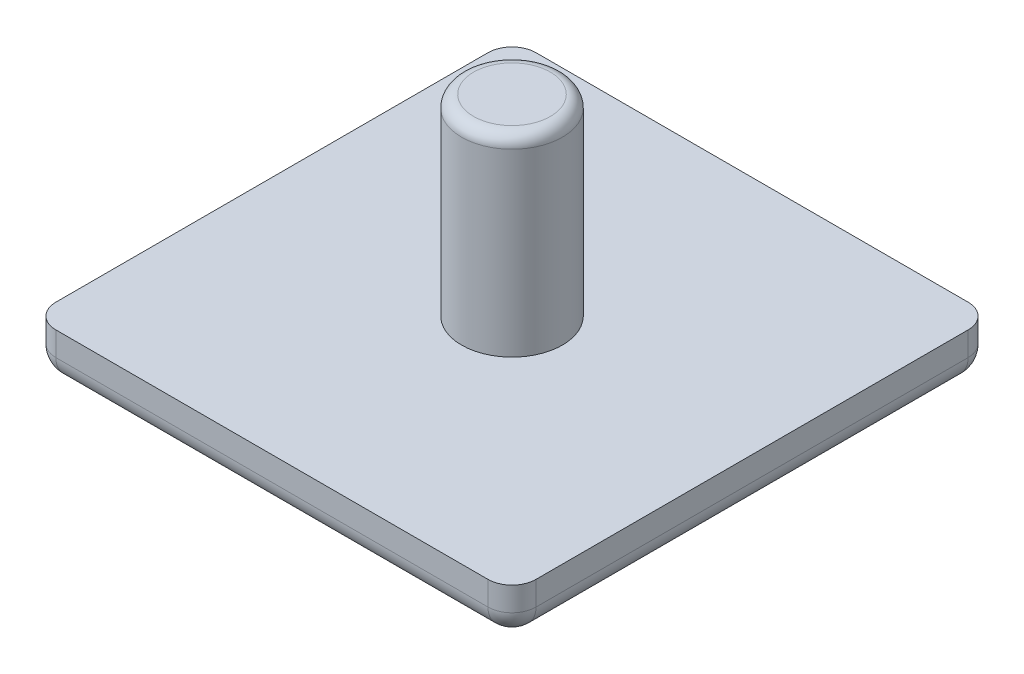
ISO-10303-21;
HEADER;
FILE_DESCRIPTION(('STEP AP214'),'2;1');
FILE_NAME('part.step','',(''),(''),'','','');
FILE_SCHEMA(('AUTOMOTIVE_DESIGN { 1 0 10303 214 1 1 1 1 }'));
ENDSEC;
DATA;
#1=APPLICATION_CONTEXT('core data for automotive mechanical design processes');
#2=APPLICATION_PROTOCOL_DEFINITION('international standard','automotive_design',2000,#1);
#3=PRODUCT_CONTEXT('',#1,'mechanical');
#4=PRODUCT('Part','Part','',(#3));
#5=PRODUCT_RELATED_PRODUCT_CATEGORY('part','',(#4));
#6=PRODUCT_DEFINITION_FORMATION('','',#4);
#7=PRODUCT_DEFINITION_CONTEXT('part definition',#1,'design');
#8=PRODUCT_DEFINITION('design','',#6,#7);
#9=PRODUCT_DEFINITION_SHAPE('','',#8);
#10=(LENGTH_UNIT() NAMED_UNIT(*) SI_UNIT(.MILLI.,.METRE.));
#11=(NAMED_UNIT(*) PLANE_ANGLE_UNIT() SI_UNIT($,.RADIAN.));
#12=(NAMED_UNIT(*) SI_UNIT($,.STERADIAN.) SOLID_ANGLE_UNIT());
#13=UNCERTAINTY_MEASURE_WITH_UNIT(LENGTH_MEASURE(1.E-05),#10,'distance_accuracy_value','');
#14=(GEOMETRIC_REPRESENTATION_CONTEXT(3) GLOBAL_UNCERTAINTY_ASSIGNED_CONTEXT((#13)) GLOBAL_UNIT_ASSIGNED_CONTEXT((#10,
#11,#12)) REPRESENTATION_CONTEXT('',''));
#15=CARTESIAN_POINT('',(0.,0.,0.));
#16=DIRECTION('',(0.,0.,1.));
#17=DIRECTION('',(1.,0.,0.));
#18=AXIS2_PLACEMENT_3D('',#15,#16,#17);
#19=CARTESIAN_POINT('',(10.,8.,-10.));
#20=DIRECTION('',(0.,-1.,0.));
#21=DIRECTION('',(0.,0.,-1.));
#22=AXIS2_PLACEMENT_3D('',#19,#20,#21);
#23=CYLINDRICAL_SURFACE('',#22,2.1);
#24=CARTESIAN_POINT('',(10.,7.5,-10.));
#25=DIRECTION('',(0.,1.,0.));
#26=DIRECTION('',(0.,0.,1.));
#27=AXIS2_PLACEMENT_3D('',#24,#25,#26);
#28=CIRCLE('',#27,2.1);
#29=CARTESIAN_POINT('',(10.,7.5,-7.9));
#30=VERTEX_POINT('',#29);
#31=EDGE_CURVE('E147',#30,#30,#28,.F.);
#32=ORIENTED_EDGE('',*,*,#31,.T.);
#33=EDGE_LOOP('',(#32));
#34=FACE_BOUND('',#33,.T.);
#35=CARTESIAN_POINT('',(10.,0.,-10.));
#36=DIRECTION('',(0.,1.,0.));
#37=DIRECTION('',(0.,0.,1.));
#38=AXIS2_PLACEMENT_3D('',#35,#36,#37);
#39=CIRCLE('',#38,2.1);
#40=CARTESIAN_POINT('',(10.,0.,-7.9));
#41=VERTEX_POINT('',#40);
#42=EDGE_CURVE('E159',#41,#41,#39,.T.);
#43=ORIENTED_EDGE('',*,*,#42,.T.);
#44=EDGE_LOOP('',(#43));
#45=FACE_BOUND('',#44,.T.);
#46=ADVANCED_FACE('F45',(#34,#45),#23,.T.);
#47=CARTESIAN_POINT('',(10.,8.,-10.));
#48=DIRECTION('',(0.,1.,0.));
#49=DIRECTION('',(0.,0.,1.));
#50=AXIS2_PLACEMENT_3D('',#47,#48,#49);
#51=PLANE('',#50);
#52=CARTESIAN_POINT('',(10.,8.,-10.));
#53=DIRECTION('',(0.,1.,0.));
#54=DIRECTION('',(0.,0.,1.));
#55=AXIS2_PLACEMENT_3D('',#52,#53,#54);
#56=CIRCLE('',#55,1.6);
#57=CARTESIAN_POINT('',(10.,8.,-8.4));
#58=VERTEX_POINT('',#57);
#59=EDGE_CURVE('E177',#58,#58,#56,.T.);
#60=ORIENTED_EDGE('',*,*,#59,.T.);
#61=EDGE_LOOP('',(#60));
#62=FACE_BOUND('',#61,.T.);
#63=ADVANCED_FACE('F284',(#62),#51,.T.);
#64=CARTESIAN_POINT('',(0.,-2.,0.));
#65=DIRECTION('',(1.,0.,0.));
#66=DIRECTION('',(0.,0.,-1.));
#67=AXIS2_PLACEMENT_3D('',#64,#65,#66);
#68=PLANE('',#67);
#69=DIRECTION('',(0.,0.,-1.));
#70=VECTOR('',#69,1.);
#71=CARTESIAN_POINT('',(0.,0.,0.));
#72=LINE('',#71,#70);
#73=CARTESIAN_POINT('',(0.,0.,-1.));
#74=VERTEX_POINT('',#73);
#75=CARTESIAN_POINT('',(0.,0.,-19.));
#76=VERTEX_POINT('',#75);
#77=EDGE_CURVE('E189',#74,#76,#72,.T.);
#78=ORIENTED_EDGE('',*,*,#77,.T.);
#79=DIRECTION('',(0.,1.,0.));
#80=VECTOR('',#79,1.);
#81=CARTESIAN_POINT('',(0.,-2.,-19.));
#82=LINE('',#81,#80);
#83=CARTESIAN_POINT('',(0.,-1.,-19.));
#84=VERTEX_POINT('',#83);
#85=EDGE_CURVE('E212',#76,#84,#82,.F.);
#86=ORIENTED_EDGE('',*,*,#85,.T.);
#87=DIRECTION('',(0.,0.,-1.));
#88=VECTOR('',#87,1.);
#89=CARTESIAN_POINT('',(0.,-1.,0.));
#90=LINE('',#89,#88);
#91=CARTESIAN_POINT('',(0.,-1.,-1.));
#92=VERTEX_POINT('',#91);
#93=EDGE_CURVE('E175',#84,#92,#90,.F.);
#94=ORIENTED_EDGE('',*,*,#93,.T.);
#95=DIRECTION('',(0.,1.,0.));
#96=VECTOR('',#95,1.);
#97=CARTESIAN_POINT('',(0.,-2.,-1.));
#98=LINE('',#97,#96);
#99=EDGE_CURVE('E135',#92,#74,#98,.T.);
#100=ORIENTED_EDGE('',*,*,#99,.T.);
#101=EDGE_LOOP('',(#78,#86,#94,#100));
#102=FACE_BOUND('',#101,.T.);
#103=ADVANCED_FACE('F240',(#102),#68,.F.);
#104=CARTESIAN_POINT('',(0.,-2.,-20.));
#105=DIRECTION('',(0.,0.,1.));
#106=DIRECTION('',(1.,0.,0.));
#107=AXIS2_PLACEMENT_3D('',#104,#105,#106);
#108=PLANE('',#107);
#109=DIRECTION('',(1.,0.,0.));
#110=VECTOR('',#109,1.);
#111=CARTESIAN_POINT('',(0.,-1.,-20.));
#112=LINE('',#111,#110);
#113=CARTESIAN_POINT('',(19.,-1.,-20.));
#114=VERTEX_POINT('',#113);
#115=CARTESIAN_POINT('',(1.,-1.,-20.));
#116=VERTEX_POINT('',#115);
#117=EDGE_CURVE('E172',#114,#116,#112,.F.);
#118=ORIENTED_EDGE('',*,*,#117,.T.);
#119=DIRECTION('',(0.,1.,0.));
#120=VECTOR('',#119,1.);
#121=CARTESIAN_POINT('',(1.,-2.,-20.));
#122=LINE('',#121,#120);
#123=CARTESIAN_POINT('',(1.,0.,-20.));
#124=VERTEX_POINT('',#123);
#125=EDGE_CURVE('E205',#116,#124,#122,.T.);
#126=ORIENTED_EDGE('',*,*,#125,.T.);
#127=DIRECTION('',(1.,0.,0.));
#128=VECTOR('',#127,1.);
#129=CARTESIAN_POINT('',(0.,0.,-20.));
#130=LINE('',#129,#128);
#131=CARTESIAN_POINT('',(19.,0.,-20.));
#132=VERTEX_POINT('',#131);
#133=EDGE_CURVE('E245',#124,#132,#130,.T.);
#134=ORIENTED_EDGE('',*,*,#133,.T.);
#135=DIRECTION('',(0.,1.,0.));
#136=VECTOR('',#135,1.);
#137=CARTESIAN_POINT('',(19.,-2.,-20.));
#138=LINE('',#137,#136);
#139=EDGE_CURVE('E203',#132,#114,#138,.F.);
#140=ORIENTED_EDGE('',*,*,#139,.T.);
#141=EDGE_LOOP('',(#118,#126,#134,#140));
#142=FACE_BOUND('',#141,.T.);
#143=ADVANCED_FACE('F265',(#142),#108,.F.);
#144=CARTESIAN_POINT('',(20.,-2.,0.));
#145=DIRECTION('',(-1.,0.,0.));
#146=DIRECTION('',(0.,0.,1.));
#147=AXIS2_PLACEMENT_3D('',#144,#145,#146);
#148=PLANE('',#147);
#149=DIRECTION('',(0.,0.,1.));
#150=VECTOR('',#149,1.);
#151=CARTESIAN_POINT('',(20.,-1.,-20.));
#152=LINE('',#151,#150);
#153=CARTESIAN_POINT('',(20.,-1.,-1.));
#154=VERTEX_POINT('',#153);
#155=CARTESIAN_POINT('',(20.,-1.,-19.));
#156=VERTEX_POINT('',#155);
#157=EDGE_CURVE('E166',#154,#156,#152,.F.);
#158=ORIENTED_EDGE('',*,*,#157,.T.);
#159=DIRECTION('',(0.,1.,0.));
#160=VECTOR('',#159,1.);
#161=CARTESIAN_POINT('',(20.,-2.,-19.));
#162=LINE('',#161,#160);
#163=CARTESIAN_POINT('',(20.,0.,-19.));
#164=VERTEX_POINT('',#163);
#165=EDGE_CURVE('E54',#156,#164,#162,.T.);
#166=ORIENTED_EDGE('',*,*,#165,.T.);
#167=DIRECTION('',(0.,0.,1.));
#168=VECTOR('',#167,1.);
#169=CARTESIAN_POINT('',(20.,0.,0.));
#170=LINE('',#169,#168);
#171=CARTESIAN_POINT('',(20.,0.,-1.));
#172=VERTEX_POINT('',#171);
#173=EDGE_CURVE('E248',#164,#172,#170,.T.);
#174=ORIENTED_EDGE('',*,*,#173,.T.);
#175=DIRECTION('',(0.,1.,0.));
#176=VECTOR('',#175,1.);
#177=CARTESIAN_POINT('',(20.,-2.,-1.));
#178=LINE('',#177,#176);
#179=EDGE_CURVE('E214',#172,#154,#178,.F.);
#180=ORIENTED_EDGE('',*,*,#179,.T.);
#181=EDGE_LOOP('',(#158,#166,#174,#180));
#182=FACE_BOUND('',#181,.T.);
#183=ADVANCED_FACE('F436',(#182),#148,.F.);
#184=CARTESIAN_POINT('',(0.,-2.,0.));
#185=DIRECTION('',(0.,0.,-1.));
#186=DIRECTION('',(-1.,0.,0.));
#187=AXIS2_PLACEMENT_3D('',#184,#185,#186);
#188=PLANE('',#187);
#189=DIRECTION('',(-1.,0.,0.));
#190=VECTOR('',#189,1.);
#191=CARTESIAN_POINT('',(20.,-1.,0.));
#192=LINE('',#191,#190);
#193=CARTESIAN_POINT('',(1.,-1.,0.));
#194=VERTEX_POINT('',#193);
#195=CARTESIAN_POINT('',(19.,-1.,0.));
#196=VERTEX_POINT('',#195);
#197=EDGE_CURVE('E146',#194,#196,#192,.F.);
#198=ORIENTED_EDGE('',*,*,#197,.T.);
#199=DIRECTION('',(0.,1.,0.));
#200=VECTOR('',#199,1.);
#201=CARTESIAN_POINT('',(19.,-2.,0.));
#202=LINE('',#201,#200);
#203=CARTESIAN_POINT('',(19.,0.,0.));
#204=VERTEX_POINT('',#203);
#205=EDGE_CURVE('E11',#196,#204,#202,.T.);
#206=ORIENTED_EDGE('',*,*,#205,.T.);
#207=DIRECTION('',(-1.,0.,0.));
#208=VECTOR('',#207,1.);
#209=CARTESIAN_POINT('',(0.,0.,0.));
#210=LINE('',#209,#208);
#211=CARTESIAN_POINT('',(1.,0.,0.));
#212=VERTEX_POINT('',#211);
#213=EDGE_CURVE('E233',#204,#212,#210,.T.);
#214=ORIENTED_EDGE('',*,*,#213,.T.);
#215=DIRECTION('',(0.,1.,0.));
#216=VECTOR('',#215,1.);
#217=CARTESIAN_POINT('',(1.,-2.,0.));
#218=LINE('',#217,#216);
#219=EDGE_CURVE('E186',#212,#194,#218,.F.);
#220=ORIENTED_EDGE('',*,*,#219,.T.);
#221=EDGE_LOOP('',(#198,#206,#214,#220));
#222=FACE_BOUND('',#221,.T.);
#223=ADVANCED_FACE('F231',(#222),#188,.F.);
#224=CARTESIAN_POINT('',(0.,-2.,0.));
#225=DIRECTION('',(0.,-1.,0.));
#226=DIRECTION('',(0.,0.,-1.));
#227=AXIS2_PLACEMENT_3D('',#224,#225,#226);
#228=PLANE('',#227);
#229=DIRECTION('',(0.,0.,1.));
#230=VECTOR('',#229,1.);
#231=CARTESIAN_POINT('',(19.,-2.,0.));
#232=LINE('',#231,#230);
#233=CARTESIAN_POINT('',(19.,-2.,-19.));
#234=VERTEX_POINT('',#233);
#235=CARTESIAN_POINT('',(19.,-2.,-1.));
#236=VERTEX_POINT('',#235);
#237=EDGE_CURVE('E164',#234,#236,#232,.T.);
#238=ORIENTED_EDGE('',*,*,#237,.T.);
#239=DIRECTION('',(-1.,0.,0.));
#240=VECTOR('',#239,1.);
#241=CARTESIAN_POINT('',(0.,-2.,-1.));
#242=LINE('',#241,#240);
#243=CARTESIAN_POINT('',(1.,-2.,-1.));
#244=VERTEX_POINT('',#243);
#245=EDGE_CURVE('E143',#236,#244,#242,.T.);
#246=ORIENTED_EDGE('',*,*,#245,.T.);
#247=DIRECTION('',(0.,0.,-1.));
#248=VECTOR('',#247,1.);
#249=CARTESIAN_POINT('',(1.,-2.,-20.));
#250=LINE('',#249,#248);
#251=CARTESIAN_POINT('',(1.,-2.,-19.));
#252=VERTEX_POINT('',#251);
#253=EDGE_CURVE('E151',#244,#252,#250,.T.);
#254=ORIENTED_EDGE('',*,*,#253,.T.);
#255=DIRECTION('',(1.,0.,0.));
#256=VECTOR('',#255,1.);
#257=CARTESIAN_POINT('',(20.,-2.,-19.));
#258=LINE('',#257,#256);
#259=EDGE_CURVE('E158',#252,#234,#258,.T.);
#260=ORIENTED_EDGE('',*,*,#259,.T.);
#261=EDGE_LOOP('',(#238,#246,#254,#260));
#262=FACE_BOUND('',#261,.T.);
#263=ADVANCED_FACE('F162',(#262),#228,.T.);
#264=CARTESIAN_POINT('',(0.,0.,0.));
#265=DIRECTION('',(0.,-1.,0.));
#266=DIRECTION('',(0.,0.,-1.));
#267=AXIS2_PLACEMENT_3D('',#264,#265,#266);
#268=PLANE('',#267);
#269=ORIENTED_EDGE('',*,*,#42,.F.);
#270=EDGE_LOOP('',(#269));
#271=FACE_BOUND('',#270,.T.);
#272=ORIENTED_EDGE('',*,*,#133,.F.);
#273=CARTESIAN_POINT('',(1.,0.,-19.));
#274=DIRECTION('',(0.,-1.,0.));
#275=DIRECTION('',(0.,0.,-1.));
#276=AXIS2_PLACEMENT_3D('',#273,#274,#275);
#277=CIRCLE('',#276,1.);
#278=EDGE_CURVE('E210',#124,#76,#277,.F.);
#279=ORIENTED_EDGE('',*,*,#278,.T.);
#280=ORIENTED_EDGE('',*,*,#77,.F.);
#281=CARTESIAN_POINT('',(1.,0.,-1.));
#282=DIRECTION('',(0.,-1.,0.));
#283=DIRECTION('',(0.,0.,-1.));
#284=AXIS2_PLACEMENT_3D('',#281,#282,#283);
#285=CIRCLE('',#284,1.);
#286=EDGE_CURVE('E183',#74,#212,#285,.F.);
#287=ORIENTED_EDGE('',*,*,#286,.T.);
#288=ORIENTED_EDGE('',*,*,#213,.F.);
#289=CARTESIAN_POINT('',(19.,0.,-1.));
#290=DIRECTION('',(0.,-1.,0.));
#291=DIRECTION('',(0.,0.,-1.));
#292=AXIS2_PLACEMENT_3D('',#289,#290,#291);
#293=CIRCLE('',#292,1.);
#294=EDGE_CURVE('E62',#204,#172,#293,.F.);
#295=ORIENTED_EDGE('',*,*,#294,.T.);
#296=ORIENTED_EDGE('',*,*,#173,.F.);
#297=CARTESIAN_POINT('',(19.,0.,-19.));
#298=DIRECTION('',(0.,-1.,0.));
#299=DIRECTION('',(0.,0.,-1.));
#300=AXIS2_PLACEMENT_3D('',#297,#298,#299);
#301=CIRCLE('',#300,1.);
#302=EDGE_CURVE('E208',#164,#132,#301,.F.);
#303=ORIENTED_EDGE('',*,*,#302,.T.);
#304=EDGE_LOOP('',(#272,#279,#280,#287,#288,#295,#296,#303));
#305=FACE_BOUND('',#304,.T.);
#306=ADVANCED_FACE('F243',(#271,#305),#268,.F.);
#307=CARTESIAN_POINT('',(0.,-1.,-19.));
#308=DIRECTION('',(-1.,0.,0.));
#309=DIRECTION('',(0.,0.,1.));
#310=AXIS2_PLACEMENT_3D('',#307,#308,#309);
#311=CYLINDRICAL_SURFACE('',#310,1.);
#312=ORIENTED_EDGE('',*,*,#259,.F.);
#313=CARTESIAN_POINT('',(1.,-1.,-19.));
#314=DIRECTION('',(-1.,0.,0.));
#315=DIRECTION('',(0.,0.,1.));
#316=AXIS2_PLACEMENT_3D('',#313,#314,#315);
#317=CIRCLE('',#316,1.);
#318=EDGE_CURVE('E194',#252,#116,#317,.F.);
#319=ORIENTED_EDGE('',*,*,#318,.T.);
#320=ORIENTED_EDGE('',*,*,#117,.F.);
#321=CARTESIAN_POINT('',(19.,-1.,-19.));
#322=DIRECTION('',(-1.,0.,0.));
#323=DIRECTION('',(0.,0.,1.));
#324=AXIS2_PLACEMENT_3D('',#321,#322,#323);
#325=CIRCLE('',#324,1.);
#326=EDGE_CURVE('E192',#114,#234,#325,.T.);
#327=ORIENTED_EDGE('',*,*,#326,.T.);
#328=EDGE_LOOP('',(#312,#319,#320,#327));
#329=FACE_BOUND('',#328,.T.);
#330=ADVANCED_FACE('F272',(#329),#311,.T.);
#331=CARTESIAN_POINT('',(19.,-1.,0.));
#332=DIRECTION('',(0.,0.,-1.));
#333=DIRECTION('',(-1.,0.,0.));
#334=AXIS2_PLACEMENT_3D('',#331,#332,#333);
#335=CYLINDRICAL_SURFACE('',#334,1.);
#336=ORIENTED_EDGE('',*,*,#237,.F.);
#337=CARTESIAN_POINT('',(19.,-1.,-19.));
#338=DIRECTION('',(0.,0.,-1.));
#339=DIRECTION('',(-1.,0.,0.));
#340=AXIS2_PLACEMENT_3D('',#337,#338,#339);
#341=CIRCLE('',#340,1.);
#342=EDGE_CURVE('E198',#234,#156,#341,.F.);
#343=ORIENTED_EDGE('',*,*,#342,.T.);
#344=ORIENTED_EDGE('',*,*,#157,.F.);
#345=CARTESIAN_POINT('',(19.,-1.,-1.));
#346=DIRECTION('',(0.,0.,-1.));
#347=DIRECTION('',(-1.,0.,0.));
#348=AXIS2_PLACEMENT_3D('',#345,#346,#347);
#349=CIRCLE('',#348,1.);
#350=EDGE_CURVE('E196',#154,#236,#349,.T.);
#351=ORIENTED_EDGE('',*,*,#350,.T.);
#352=EDGE_LOOP('',(#336,#343,#344,#351));
#353=FACE_BOUND('',#352,.T.);
#354=ADVANCED_FACE('F256',(#353),#335,.T.);
#355=CARTESIAN_POINT('',(1.,-1.,0.));
#356=DIRECTION('',(0.,0.,1.));
#357=DIRECTION('',(1.,0.,0.));
#358=AXIS2_PLACEMENT_3D('',#355,#356,#357);
#359=CYLINDRICAL_SURFACE('',#358,1.);
#360=ORIENTED_EDGE('',*,*,#93,.F.);
#361=CARTESIAN_POINT('',(1.,-1.,-19.));
#362=DIRECTION('',(0.,0.,1.));
#363=DIRECTION('',(1.,0.,0.));
#364=AXIS2_PLACEMENT_3D('',#361,#362,#363);
#365=CIRCLE('',#364,1.);
#366=EDGE_CURVE('E154',#84,#252,#365,.T.);
#367=ORIENTED_EDGE('',*,*,#366,.T.);
#368=ORIENTED_EDGE('',*,*,#253,.F.);
#369=CARTESIAN_POINT('',(1.,-1.,-1.));
#370=DIRECTION('',(0.,0.,1.));
#371=DIRECTION('',(1.,0.,0.));
#372=AXIS2_PLACEMENT_3D('',#369,#370,#371);
#373=CIRCLE('',#372,1.);
#374=EDGE_CURVE('E125',#244,#92,#373,.F.);
#375=ORIENTED_EDGE('',*,*,#374,.T.);
#376=EDGE_LOOP('',(#360,#367,#368,#375));
#377=FACE_BOUND('',#376,.T.);
#378=ADVANCED_FACE('F152',(#377),#359,.T.);
#379=CARTESIAN_POINT('',(0.,-1.,-1.));
#380=DIRECTION('',(1.,0.,0.));
#381=DIRECTION('',(0.,0.,-1.));
#382=AXIS2_PLACEMENT_3D('',#379,#380,#381);
#383=CYLINDRICAL_SURFACE('',#382,1.);
#384=ORIENTED_EDGE('',*,*,#245,.F.);
#385=CARTESIAN_POINT('',(19.,-1.,-1.));
#386=DIRECTION('',(1.,0.,0.));
#387=DIRECTION('',(0.,0.,-1.));
#388=AXIS2_PLACEMENT_3D('',#385,#386,#387);
#389=CIRCLE('',#388,1.);
#390=EDGE_CURVE('E201',#236,#196,#389,.F.);
#391=ORIENTED_EDGE('',*,*,#390,.T.);
#392=ORIENTED_EDGE('',*,*,#197,.F.);
#393=CARTESIAN_POINT('',(1.,-1.,-1.));
#394=DIRECTION('',(1.,0.,0.));
#395=DIRECTION('',(0.,0.,-1.));
#396=AXIS2_PLACEMENT_3D('',#393,#394,#395);
#397=CIRCLE('',#396,1.);
#398=EDGE_CURVE('E128',#194,#244,#397,.T.);
#399=ORIENTED_EDGE('',*,*,#398,.T.);
#400=EDGE_LOOP('',(#384,#391,#392,#399));
#401=FACE_BOUND('',#400,.T.);
#402=ADVANCED_FACE('F140',(#401),#383,.T.);
#403=CARTESIAN_POINT('',(10.,7.5,-10.));
#404=DIRECTION('',(0.,1.,0.));
#405=DIRECTION('',(0.,0.,1.));
#406=AXIS2_PLACEMENT_3D('',#403,#404,#405);
#407=TOROIDAL_SURFACE('',#406,1.6,0.5);
#408=ORIENTED_EDGE('',*,*,#31,.F.);
#409=EDGE_LOOP('',(#408));
#410=FACE_BOUND('',#409,.T.);
#411=ORIENTED_EDGE('',*,*,#59,.F.);
#412=EDGE_LOOP('',(#411));
#413=FACE_BOUND('',#412,.T.);
#414=ADVANCED_FACE('F297',(#410,#413),#407,.T.);
#415=CARTESIAN_POINT('',(1.,-2.,-1.));
#416=DIRECTION('',(0.,1.,0.));
#417=DIRECTION('',(0.,0.,1.));
#418=AXIS2_PLACEMENT_3D('',#415,#416,#417);
#419=CYLINDRICAL_SURFACE('',#418,1.);
#420=ORIENTED_EDGE('',*,*,#286,.F.);
#421=ORIENTED_EDGE('',*,*,#99,.F.);
#422=CARTESIAN_POINT('',(1.,-1.,-1.));
#423=DIRECTION('',(0.,-1.,0.));
#424=DIRECTION('',(0.,0.,-1.));
#425=AXIS2_PLACEMENT_3D('',#422,#423,#424);
#426=CIRCLE('',#425,1.);
#427=EDGE_CURVE('E130',#194,#92,#426,.T.);
#428=ORIENTED_EDGE('',*,*,#427,.F.);
#429=ORIENTED_EDGE('',*,*,#219,.F.);
#430=EDGE_LOOP('',(#420,#421,#428,#429));
#431=FACE_BOUND('',#430,.T.);
#432=ADVANCED_FACE('F236',(#431),#419,.T.);
#433=CARTESIAN_POINT('',(1.,-1.,-1.));
#434=DIRECTION('',(0.,0.,1.));
#435=DIRECTION('',(1.,0.,0.));
#436=AXIS2_PLACEMENT_3D('',#433,#434,#435);
#437=SPHERICAL_SURFACE('',#436,1.);
#438=ORIENTED_EDGE('',*,*,#427,.T.);
#439=ORIENTED_EDGE('',*,*,#374,.F.);
#440=ORIENTED_EDGE('',*,*,#398,.F.);
#441=EDGE_LOOP('',(#438,#439,#440));
#442=FACE_BOUND('',#441,.T.);
#443=ADVANCED_FACE('F127',(#442),#437,.T.);
#444=CARTESIAN_POINT('',(1.,-2.,-19.));
#445=DIRECTION('',(0.,1.,0.));
#446=DIRECTION('',(0.,0.,1.));
#447=AXIS2_PLACEMENT_3D('',#444,#445,#446);
#448=CYLINDRICAL_SURFACE('',#447,1.);
#449=ORIENTED_EDGE('',*,*,#278,.F.);
#450=ORIENTED_EDGE('',*,*,#125,.F.);
#451=CARTESIAN_POINT('',(1.,-1.,-19.));
#452=DIRECTION('',(0.,-1.,0.));
#453=DIRECTION('',(0.,0.,-1.));
#454=AXIS2_PLACEMENT_3D('',#451,#452,#453);
#455=CIRCLE('',#454,1.);
#456=EDGE_CURVE('E190',#84,#116,#455,.T.);
#457=ORIENTED_EDGE('',*,*,#456,.F.);
#458=ORIENTED_EDGE('',*,*,#85,.F.);
#459=EDGE_LOOP('',(#449,#450,#457,#458));
#460=FACE_BOUND('',#459,.T.);
#461=ADVANCED_FACE('F269',(#460),#448,.T.);
#462=CARTESIAN_POINT('',(1.,-1.,-19.));
#463=DIRECTION('',(0.,0.,1.));
#464=DIRECTION('',(1.,0.,0.));
#465=AXIS2_PLACEMENT_3D('',#462,#463,#464);
#466=SPHERICAL_SURFACE('',#465,1.);
#467=ORIENTED_EDGE('',*,*,#456,.T.);
#468=ORIENTED_EDGE('',*,*,#318,.F.);
#469=ORIENTED_EDGE('',*,*,#366,.F.);
#470=EDGE_LOOP('',(#467,#468,#469));
#471=FACE_BOUND('',#470,.T.);
#472=ADVANCED_FACE('F271',(#471),#466,.T.);
#473=CARTESIAN_POINT('',(19.,-2.,-19.));
#474=DIRECTION('',(0.,1.,0.));
#475=DIRECTION('',(0.,0.,1.));
#476=AXIS2_PLACEMENT_3D('',#473,#474,#475);
#477=CYLINDRICAL_SURFACE('',#476,1.);
#478=ORIENTED_EDGE('',*,*,#302,.F.);
#479=ORIENTED_EDGE('',*,*,#165,.F.);
#480=CARTESIAN_POINT('',(19.,-1.,-19.));
#481=DIRECTION('',(0.,-1.,0.));
#482=DIRECTION('',(0.,0.,-1.));
#483=AXIS2_PLACEMENT_3D('',#480,#481,#482);
#484=CIRCLE('',#483,1.);
#485=EDGE_CURVE('E218',#114,#156,#484,.T.);
#486=ORIENTED_EDGE('',*,*,#485,.F.);
#487=ORIENTED_EDGE('',*,*,#139,.F.);
#488=EDGE_LOOP('',(#478,#479,#486,#487));
#489=FACE_BOUND('',#488,.T.);
#490=ADVANCED_FACE('F263',(#489),#477,.T.);
#491=CARTESIAN_POINT('',(19.,-1.,-19.));
#492=DIRECTION('',(0.,0.,1.));
#493=DIRECTION('',(1.,0.,0.));
#494=AXIS2_PLACEMENT_3D('',#491,#492,#493);
#495=SPHERICAL_SURFACE('',#494,1.);
#496=ORIENTED_EDGE('',*,*,#342,.F.);
#497=ORIENTED_EDGE('',*,*,#326,.F.);
#498=ORIENTED_EDGE('',*,*,#485,.T.);
#499=EDGE_LOOP('',(#496,#497,#498));
#500=FACE_BOUND('',#499,.T.);
#501=ADVANCED_FACE('F258',(#500),#495,.T.);
#502=CARTESIAN_POINT('',(19.,-2.,-1.));
#503=DIRECTION('',(0.,1.,0.));
#504=DIRECTION('',(0.,0.,1.));
#505=AXIS2_PLACEMENT_3D('',#502,#503,#504);
#506=CYLINDRICAL_SURFACE('',#505,1.);
#507=ORIENTED_EDGE('',*,*,#294,.F.);
#508=ORIENTED_EDGE('',*,*,#205,.F.);
#509=CARTESIAN_POINT('',(19.,-1.,-1.));
#510=DIRECTION('',(0.,-1.,0.));
#511=DIRECTION('',(0.,0.,-1.));
#512=AXIS2_PLACEMENT_3D('',#509,#510,#511);
#513=CIRCLE('',#512,1.);
#514=EDGE_CURVE('E49',#154,#196,#513,.T.);
#515=ORIENTED_EDGE('',*,*,#514,.F.);
#516=ORIENTED_EDGE('',*,*,#179,.F.);
#517=EDGE_LOOP('',(#507,#508,#515,#516));
#518=FACE_BOUND('',#517,.T.);
#519=ADVANCED_FACE('F47',(#518),#506,.T.);
#520=CARTESIAN_POINT('',(19.,-1.,-1.));
#521=DIRECTION('',(0.,0.,1.));
#522=DIRECTION('',(1.,0.,0.));
#523=AXIS2_PLACEMENT_3D('',#520,#521,#522);
#524=SPHERICAL_SURFACE('',#523,1.);
#525=ORIENTED_EDGE('',*,*,#390,.F.);
#526=ORIENTED_EDGE('',*,*,#350,.F.);
#527=ORIENTED_EDGE('',*,*,#514,.T.);
#528=EDGE_LOOP('',(#525,#526,#527));
#529=FACE_BOUND('',#528,.T.);
#530=ADVANCED_FACE('F227',(#529),#524,.T.);
#531=CLOSED_SHELL('',(#46,#63,#103,#143,#183,#223,#263,#306,#330,#354,#378,#402,#414,#432,#443,
#461,#472,#490,#501,#519,#530));
#532=MANIFOLD_SOLID_BREP('B2',#531);
#533=ADVANCED_BREP_SHAPE_REPRESENTATION('',(#18,#532),#14);
#534=SHAPE_DEFINITION_REPRESENTATION(#9,#533);
ENDSEC;
END-ISO-10303-21;
